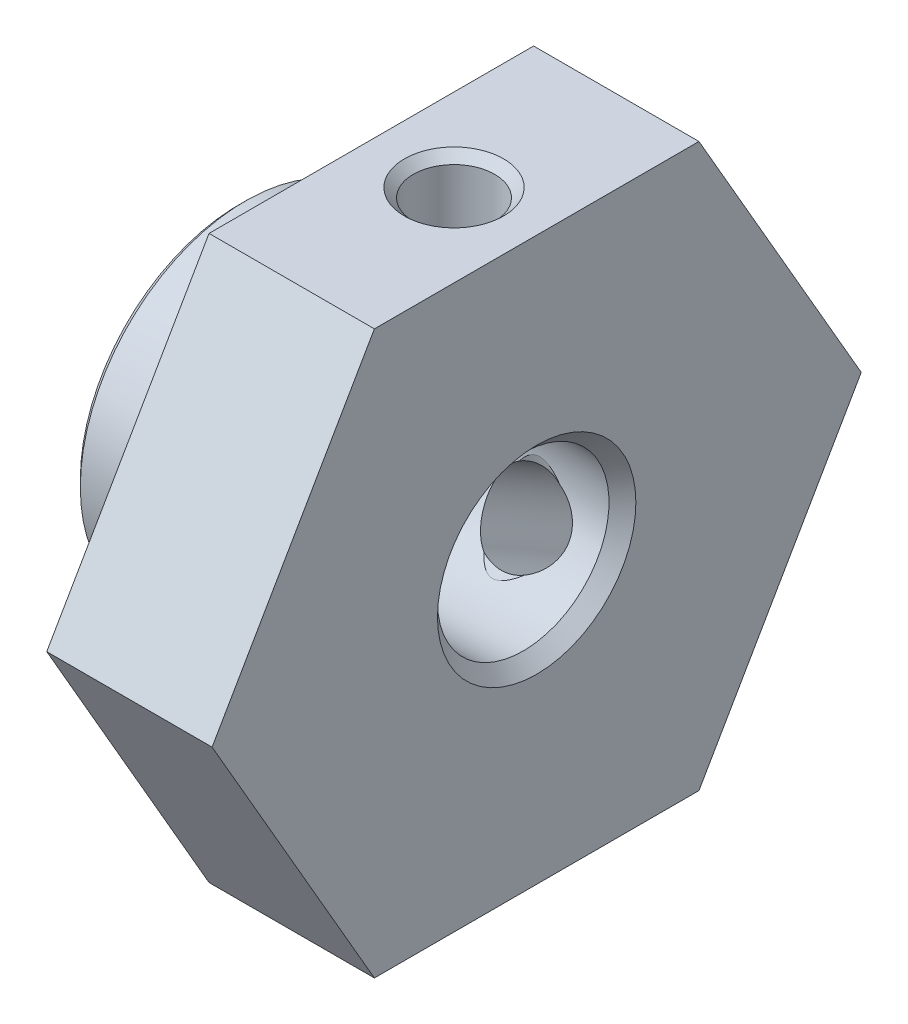
ISO-10303-21;
HEADER;
FILE_DESCRIPTION(('STEP AP214'),'2;1');
FILE_NAME('part.step','',(''),(''),'','','');
FILE_SCHEMA(('AUTOMOTIVE_DESIGN { 1 0 10303 214 1 1 1 1 }'));
ENDSEC;
DATA;
#1=APPLICATION_CONTEXT('core data for automotive mechanical design processes');
#2=APPLICATION_PROTOCOL_DEFINITION('international standard','automotive_design',2000,#1);
#3=PRODUCT_CONTEXT('',#1,'mechanical');
#4=PRODUCT('Part','Part','',(#3));
#5=PRODUCT_RELATED_PRODUCT_CATEGORY('part','',(#4));
#6=PRODUCT_DEFINITION_FORMATION('','',#4);
#7=PRODUCT_DEFINITION_CONTEXT('part definition',#1,'design');
#8=PRODUCT_DEFINITION('design','',#6,#7);
#9=PRODUCT_DEFINITION_SHAPE('','',#8);
#10=(LENGTH_UNIT() NAMED_UNIT(*) SI_UNIT(.MILLI.,.METRE.));
#11=(NAMED_UNIT(*) PLANE_ANGLE_UNIT() SI_UNIT($,.RADIAN.));
#12=(NAMED_UNIT(*) SI_UNIT($,.STERADIAN.) SOLID_ANGLE_UNIT());
#13=UNCERTAINTY_MEASURE_WITH_UNIT(LENGTH_MEASURE(1.E-05),#10,'distance_accuracy_value','');
#14=(GEOMETRIC_REPRESENTATION_CONTEXT(3) GLOBAL_UNCERTAINTY_ASSIGNED_CONTEXT((#13)) GLOBAL_UNIT_ASSIGNED_CONTEXT((#10,
#11,#12)) REPRESENTATION_CONTEXT('',''));
#15=CARTESIAN_POINT('',(0.,0.,0.));
#16=DIRECTION('',(0.,0.,1.));
#17=DIRECTION('',(1.,0.,0.));
#18=AXIS2_PLACEMENT_3D('',#15,#16,#17);
#19=CARTESIAN_POINT('',(9.,0.,0.));
#20=DIRECTION('',(-1.,0.,0.));
#21=DIRECTION('',(0.,0.,1.));
#22=AXIS2_PLACEMENT_3D('',#19,#20,#21);
#23=CYLINDRICAL_SURFACE('',#22,2.594);
#24=CARTESIAN_POINT('',(7.11130557007114,2.3645,1.06675946210943));
#25=CARTESIAN_POINT('',(7.17283329924307,2.3804229380834,1.03150297527811));
#26=CARTESIAN_POINT('',(7.23100469290972,2.39769226485528,0.991096037235716));
#27=CARTESIAN_POINT('',(7.3395891225195,2.43298344496804,0.900970580013275));
#28=CARTESIAN_POINT('',(7.3899853603298,2.45100682359714,0.851232400313027));
#29=CARTESIAN_POINT('',(7.48172195312881,2.48578882449009,0.743569384561638));
#30=CARTESIAN_POINT('',(7.52305827806804,2.50254688174719,0.685640924064241));
#31=CARTESIAN_POINT('',(7.59536277935605,2.53296409349983,0.562947576229603));
#32=CARTESIAN_POINT('',(7.62634213759102,2.54662658494757,0.498190161813476));
#33=CARTESIAN_POINT('',(7.67585190954529,2.56891442894227,0.365864181544286));
#34=CARTESIAN_POINT('',(7.69477657824279,2.57769795200646,0.298470837593822));
#35=CARTESIAN_POINT('',(7.72091963585622,2.58991766875234,0.160977536591798));
#36=CARTESIAN_POINT('',(7.72814352084603,2.59335637296332,0.0908788661333901));
#37=CARTESIAN_POINT('',(7.7304039258054,2.59442907430037,-0.0433039996482899));
#38=CARTESIAN_POINT('',(7.72646568455094,2.59255139670274,-0.107369542585981));
#39=CARTESIAN_POINT('',(7.70875145148675,2.58421839728226,-0.233802702347454));
#40=CARTESIAN_POINT('',(7.69497697513279,2.57776378062347,-0.296170579191969));
#41=CARTESIAN_POINT('',(7.65839685575418,2.56101343778478,-0.416790229436451));
#42=CARTESIAN_POINT('',(7.63570217785813,2.55076499373923,-0.475082584822805));
#43=CARTESIAN_POINT('',(7.58204880060987,2.52733331209461,-0.587114008215008));
#44=CARTESIAN_POINT('',(7.55108450547569,2.51414808827854,-0.640849960491106));
#45=CARTESIAN_POINT('',(7.47904554042583,2.48486031259046,-0.74669317815188));
#46=CARTESIAN_POINT('',(7.43737410431928,2.46861099473553,-0.798352982167304));
#47=CARTESIAN_POINT('',(7.34644987279231,2.43553938828726,-0.894175606907266));
#48=CARTESIAN_POINT('',(7.29720532396884,2.41871773825796,-0.938346473863556));
#49=CARTESIAN_POINT('',(7.20226811547265,2.38929497345709,-1.0106078768721));
#50=CARTESIAN_POINT('',(7.15773519659284,2.37650749911475,-1.04015588903911));
#51=CARTESIAN_POINT('',(7.11130557007114,2.3645,-1.06675946210943));
#52=B_SPLINE_CURVE_WITH_KNOTS('',3,(#24,#25,#26,#27,#28,#29,#30,#31,#32,#33,#34,#35,#36,#37,#38,
#39,#40,#41,#42,#43,#44,#45,#46,#47,#48,#49,#50,#51),.UNSPECIFIED.,.F.,.F.,(4,2,2,2,2,2,2,2,2,2,
2,2,2,4),(0.,0.217712384053668,0.435888737857731,0.65416194524353,0.87219872740545,
1.08267855476251,1.2930594871622,1.48475928203588,1.67642954834547,1.8657873327121,
2.05527357543357,2.25941617927635,2.46333803971736,2.62775890244638),.UNSPECIFIED.);
#53=CARTESIAN_POINT('',(7.11130557007512,2.3645000000015,1.06675946210748));
#54=VERTEX_POINT('',#53);
#55=CARTESIAN_POINT('',(7.11130557007114,2.3645,-1.06675946210943));
#56=VERTEX_POINT('',#55);
#57=EDGE_CURVE('E171',#54,#56,#52,.T.);
#58=ORIENTED_EDGE('',*,*,#57,.T.);
#59=CARTESIAN_POINT('',(7.16108783455756,2.39175,-1.00417525238377));
#60=CARTESIAN_POINT('',(7.13608003947019,2.37788866149612,-1.03721696126421));
#61=CARTESIAN_POINT('',(7.10992590509249,2.36362114904351,-1.06925485586839));
#62=CARTESIAN_POINT('',(7.05493172403082,2.33459008003922,-1.13123488475205));
#63=CARTESIAN_POINT('',(7.02607078006603,2.31982334284631,-1.16115694136222));
#64=CARTESIAN_POINT('',(6.96441720097789,2.2897399994607,-1.21944629923076));
#65=CARTESIAN_POINT('',(6.93151019585101,2.27442641614085,-1.24769511322171));
#66=CARTESIAN_POINT('',(6.86242438203194,2.24477739361206,-1.30027290179945));
#67=CARTESIAN_POINT('',(6.82625925094741,2.23043827138959,-1.32461717049315));
#68=CARTESIAN_POINT('',(6.76409894466059,2.20914823631686,-1.35968895397653));
#69=CARTESIAN_POINT('',(6.7393346976943,2.20143507415852,-1.37211049400494));
#70=CARTESIAN_POINT('',(6.6881944720094,2.187691695571,-1.39391738207763));
#71=CARTESIAN_POINT('',(6.66182937968586,2.181651389609,-1.40332098944318));
#72=CARTESIAN_POINT('',(6.61175544201868,2.172777149557,-1.41701542071826));
#73=CARTESIAN_POINT('',(6.58826998993999,2.16959093868402,-1.42187347582485));
#74=CARTESIAN_POINT('',(6.54065241512918,2.16545325011568,-1.42816790604346));
#75=CARTESIAN_POINT('',(6.51652109668275,2.16449911287724,-1.4296083533062));
#76=CARTESIAN_POINT('',(6.46831317592316,2.16499459796807,-1.42885770511199));
#77=CARTESIAN_POINT('',(6.44423667827866,2.16644719646536,-1.42666211333286));
#78=CARTESIAN_POINT('',(6.39685225175569,2.17150331242237,-1.41895370394312));
#79=CARTESIAN_POINT('',(6.3735454798292,2.17510992493096,-1.41343611294238));
#80=CARTESIAN_POINT('',(6.31675094919156,2.18617969269061,-1.39628120575765));
#81=CARTESIAN_POINT('',(6.28398523047991,2.19466919183898,-1.38296408198598));
#82=CARTESIAN_POINT('',(6.22096050541412,2.21380935145997,-1.35211561707521));
#83=CARTESIAN_POINT('',(6.19072512739402,2.22447773812005,-1.33454947719555));
#84=CARTESIAN_POINT('',(6.12945354585624,2.24810701186622,-1.29439243490119));
#85=CARTESIAN_POINT('',(6.09869150212539,2.26119101610582,-1.271462081225));
#86=CARTESIAN_POINT('',(6.0395945534333,2.28785425328316,-1.2228376503025));
#87=CARTESIAN_POINT('',(6.01126462498815,2.30143442420166,-1.19713813817876));
#88=CARTESIAN_POINT('',(5.95782296739839,2.32804903477104,-1.14449125500444));
#89=CARTESIAN_POINT('',(5.93263075741153,2.34108499624447,-1.11762577711052));
#90=CARTESIAN_POINT('',(5.88429694016077,2.36676686794831,-1.06216200520743));
#91=CARTESIAN_POINT('',(5.86114691842565,2.37941422385326,-1.03357172623689));
#92=CARTESIAN_POINT('',(5.83891216544247,2.39175000000004,-1.00417525238375));
#93=B_SPLINE_CURVE_WITH_KNOTS('',3,(#59,#60,#61,#62,#63,#64,#65,#66,#67,#68,#69,#70,#71,#72,#73,
#74,#75,#76,#77,#78,#79,#80,#81,#82,#83,#84,#85,#86,#87,#88,#89,#90,#91,#92),.UNSPECIFIED.,.F.,
.F.,(4,2,2,2,2,2,2,2,2,2,2,2,2,2,2,2,4),(0.,0.131097506093573,0.26330680666177,
0.401082051116758,0.538303705305195,0.624401304954405,0.709967715530863,0.78224515604404,
0.854436433141115,0.926717048574926,0.999101772932259,1.10760062347554,1.21702008337913,
1.33840819179224,1.46003903788386,1.57714872811023,1.69375084203825),.UNSPECIFIED.);
#94=CARTESIAN_POINT('',(5.88869442992886,2.3645,-1.06675946210943));
#95=VERTEX_POINT('',#94);
#96=EDGE_CURVE('E125',#56,#95,#93,.T.);
#97=ORIENTED_EDGE('',*,*,#96,.T.);
#98=CARTESIAN_POINT('',(5.88869442992886,2.3645,-1.06675946210943));
#99=CARTESIAN_POINT('',(5.82716670075693,2.3804229380834,-1.03150297527811));
#100=CARTESIAN_POINT('',(5.76899530709028,2.39769226485528,-0.991096037235716));
#101=CARTESIAN_POINT('',(5.6604108774805,2.43298344496804,-0.900970580013275));
#102=CARTESIAN_POINT('',(5.6100146396702,2.45100682359714,-0.851232400313027));
#103=CARTESIAN_POINT('',(5.51827804687119,2.48578882449009,-0.743569384561638));
#104=CARTESIAN_POINT('',(5.47694172193196,2.50254688174719,-0.685640924064241));
#105=CARTESIAN_POINT('',(5.40463722064395,2.53296409349983,-0.562947576229603));
#106=CARTESIAN_POINT('',(5.37365786240897,2.54662658494757,-0.498190161813476));
#107=CARTESIAN_POINT('',(5.32414809045471,2.56891442894227,-0.365864181544286));
#108=CARTESIAN_POINT('',(5.30522342175721,2.57769795200646,-0.298470837593822));
#109=CARTESIAN_POINT('',(5.27908036414378,2.58991766875234,-0.160977536591798));
#110=CARTESIAN_POINT('',(5.27185647915397,2.59335637296332,-0.0908788661333902));
#111=CARTESIAN_POINT('',(5.2695960741946,2.59442907430037,0.0433039996482899));
#112=CARTESIAN_POINT('',(5.27353431544906,2.59255139670274,0.107369542585981));
#113=CARTESIAN_POINT('',(5.29124854851325,2.58421839728226,0.233802702347454));
#114=CARTESIAN_POINT('',(5.30502302486721,2.57776378062347,0.296170579191969));
#115=CARTESIAN_POINT('',(5.34160314424582,2.56101343778478,0.416790229436451));
#116=CARTESIAN_POINT('',(5.36429782214187,2.55076499373923,0.475082584822805));
#117=CARTESIAN_POINT('',(5.41795119939013,2.52733331209461,0.587114008215008));
#118=CARTESIAN_POINT('',(5.4489154945243,2.51414808827854,0.640849960491106));
#119=CARTESIAN_POINT('',(5.52095445957417,2.48486031259046,0.74669317815188));
#120=CARTESIAN_POINT('',(5.56262589568072,2.46861099473553,0.798352982167304));
#121=CARTESIAN_POINT('',(5.65355012720769,2.43553938828726,0.894175606907266));
#122=CARTESIAN_POINT('',(5.70279467603116,2.41871773825796,0.938346473863556));
#123=CARTESIAN_POINT('',(5.79773188452735,2.38929497345709,1.0106078768721));
#124=CARTESIAN_POINT('',(5.84226480340716,2.37650749911475,1.04015588903911));
#125=CARTESIAN_POINT('',(5.88869442992886,2.3645,1.06675946210943));
#126=B_SPLINE_CURVE_WITH_KNOTS('',3,(#98,#99,#100,#101,#102,#103,#104,#105,#106,#107,#108,#109,
#110,#111,#112,#113,#114,#115,#116,#117,#118,#119,#120,#121,#122,#123,#124,#125),.UNSPECIFIED.,
.F.,.F.,(4,2,2,2,2,2,2,2,2,2,2,2,2,4),(0.,0.217712384053668,0.435888737857731,0.65416194524353,
0.87219872740545,1.0826785547625,1.2930594871622,1.48475928203588,1.67642954834547,
1.8657873327121,2.05527357543357,2.25941617927635,2.46333803971736,2.62775890244638),.UNSPECIFIED.);
#127=CARTESIAN_POINT('',(5.88869442992886,2.3645,1.06675946210943));
#128=VERTEX_POINT('',#127);
#129=EDGE_CURVE('E127',#95,#128,#126,.T.);
#130=ORIENTED_EDGE('',*,*,#129,.T.);
#131=CARTESIAN_POINT('',(5.83891216544244,2.39175,1.00417525238377));
#132=CARTESIAN_POINT('',(5.86391996052981,2.37788866149612,1.03721696126421));
#133=CARTESIAN_POINT('',(5.89007409490751,2.36362114904351,1.06925485586839));
#134=CARTESIAN_POINT('',(5.94506827596918,2.33459008003922,1.13123488475205));
#135=CARTESIAN_POINT('',(5.97392921993397,2.31982334284631,1.16115694136222));
#136=CARTESIAN_POINT('',(6.03558279902211,2.2897399994607,1.21944629923076));
#137=CARTESIAN_POINT('',(6.06848980414899,2.27442641614085,1.24769511322171));
#138=CARTESIAN_POINT('',(6.13757561796806,2.24477739361206,1.30027290179945));
#139=CARTESIAN_POINT('',(6.17374074905259,2.23043827138959,1.32461717049315));
#140=CARTESIAN_POINT('',(6.23590105533941,2.20914823631686,1.35968895397653));
#141=CARTESIAN_POINT('',(6.2606653023057,2.20143507415852,1.37211049400494));
#142=CARTESIAN_POINT('',(6.3118055279906,2.187691695571,1.39391738207763));
#143=CARTESIAN_POINT('',(6.33817062031414,2.181651389609,1.40332098944318));
#144=CARTESIAN_POINT('',(6.38824455798132,2.172777149557,1.41701542071826));
#145=CARTESIAN_POINT('',(6.41173001006001,2.16959093868402,1.42187347582485));
#146=CARTESIAN_POINT('',(6.45934758487082,2.16545325011568,1.42816790604346));
#147=CARTESIAN_POINT('',(6.48347890331725,2.16449911287724,1.4296083533062));
#148=CARTESIAN_POINT('',(6.53168682407684,2.16499459796807,1.42885770511199));
#149=CARTESIAN_POINT('',(6.55576332172134,2.16644719646536,1.42666211333286));
#150=CARTESIAN_POINT('',(6.60314774824431,2.17150331242237,1.41895370394312));
#151=CARTESIAN_POINT('',(6.6264545201708,2.17510992493096,1.41343611294238));
#152=CARTESIAN_POINT('',(6.68324905080844,2.18617969269061,1.39628120575765));
#153=CARTESIAN_POINT('',(6.71601476952009,2.19466919183898,1.38296408198598));
#154=CARTESIAN_POINT('',(6.77903949458588,2.21380935145997,1.35211561707521));
#155=CARTESIAN_POINT('',(6.80927487260598,2.22447773812005,1.33454947719555));
#156=CARTESIAN_POINT('',(6.87054645414376,2.24810701186622,1.29439243490119));
#157=CARTESIAN_POINT('',(6.90130849787461,2.26119101610582,1.271462081225));
#158=CARTESIAN_POINT('',(6.9604054465667,2.28785425328316,1.2228376503025));
#159=CARTESIAN_POINT('',(6.98873537501185,2.30143442420166,1.19713813817876));
#160=CARTESIAN_POINT('',(7.0421770326016,2.32804903477104,1.14449125500444));
#161=CARTESIAN_POINT('',(7.06736924258847,2.34108499624447,1.11762577711052));
#162=CARTESIAN_POINT('',(7.11570305983923,2.36676686794831,1.06216200520743));
#163=CARTESIAN_POINT('',(7.13885308157434,2.37941422385326,1.03357172623689));
#164=CARTESIAN_POINT('',(7.16108783455752,2.39175000000004,1.00417525238375));
#165=B_SPLINE_CURVE_WITH_KNOTS('',3,(#131,#132,#133,#134,#135,#136,#137,#138,#139,#140,#141,
#142,#143,#144,#145,#146,#147,#148,#149,#150,#151,#152,#153,#154,#155,#156,#157,#158,#159,#160,
#161,#162,#163,#164),.UNSPECIFIED.,.F.,.F.,(4,2,2,2,2,2,2,2,2,2,2,2,2,2,2,2,4),(0.,
0.131097506093572,0.26330680666177,0.401082051116758,0.538303705305195,0.624401304954403,
0.709967715530863,0.78224515604404,0.854436433141115,0.926717048574927,0.999101772932259,
1.10760062347554,1.21702008337913,1.33840819179224,1.46003903788386,1.57714872811023,
1.69375084203825),.UNSPECIFIED.);
#166=EDGE_CURVE('E164',#128,#54,#165,.T.);
#167=ORIENTED_EDGE('',*,*,#166,.T.);
#168=EDGE_LOOP('',(#58,#97,#130,#167));
#169=FACE_BOUND('',#168,.T.);
#170=CARTESIAN_POINT('',(0.406,0.,0.));
#171=DIRECTION('',(-1.,0.,0.));
#172=DIRECTION('',(0.,0.,1.));
#173=AXIS2_PLACEMENT_3D('',#170,#171,#172);
#174=CIRCLE('',#173,2.594);
#175=CARTESIAN_POINT('',(0.406,0.,2.594));
#176=VERTEX_POINT('',#175);
#177=EDGE_CURVE('E241',#176,#176,#174,.T.);
#178=ORIENTED_EDGE('',*,*,#177,.T.);
#179=EDGE_LOOP('',(#178));
#180=FACE_BOUND('',#179,.T.);
#181=CARTESIAN_POINT('',(8.594,0.,0.));
#182=DIRECTION('',(-1.,0.,0.));
#183=DIRECTION('',(0.,0.,1.));
#184=AXIS2_PLACEMENT_3D('',#181,#182,#183);
#185=CIRCLE('',#184,2.594);
#186=CARTESIAN_POINT('',(8.594,0.,2.594));
#187=VERTEX_POINT('',#186);
#188=EDGE_CURVE('E238',#187,#187,#185,.T.);
#189=ORIENTED_EDGE('',*,*,#188,.F.);
#190=EDGE_LOOP('',(#189));
#191=FACE_BOUND('',#190,.T.);
#192=CARTESIAN_POINT('',(5.88869442992874,-2.10609079391417,-1.51433733619361));
#193=CARTESIAN_POINT('',(5.82716670075681,-2.08351924971175,-1.54575524849239));
#194=CARTESIAN_POINT('',(5.76899530709017,-2.05716047826383,-1.5809143932043));
#195=CARTESIAN_POINT('',(5.66041087748039,-1.99675513283788,-1.65654018032271));
#196=CARTESIAN_POINT('',(5.6100146396701,-1.96269229499402,-1.69701797392766));
#197=CARTESIAN_POINT('',(5.5182780468711,-1.88684438875173,-1.78097157817111));
#198=CARTESIAN_POINT('',(5.47694172193187,-1.84505589898741,-1.82444871172253));
#199=CARTESIAN_POINT('',(5.40463722064387,-1.75400894876356,-1.91213746372993));
#200=CARTESIAN_POINT('',(5.3736578624089,-1.70475862851967,-1.95634823561073));
#201=CARTESIAN_POINT('',(5.32414809045465,-1.60130489002321,-2.04181306484032));
#202=CARTESIAN_POINT('',(5.30522342175715,-1.54733230364822,-2.08311649092387));
#203=CARTESIAN_POINT('',(5.27908036414373,-1.43436947050322,-2.16244572655386));
#204=CARTESIAN_POINT('',(5.27185647915394,-1.37538159322021,-2.20047306698586));
#205=CARTESIAN_POINT('',(5.26959607419458,-1.2597121733692,-2.26849348648526));
#206=CARTESIAN_POINT('',(5.27353431544904,-1.2032909468791,-2.29890014145443));
#207=CARTESIAN_POINT('',(5.29124854851325,-1.08963011893469,-2.35490013214732));
#208=CARTESIAN_POINT('',(5.30502302486721,-1.03239064487785,-2.38049420857136));
#209=CARTESIAN_POINT('',(5.34160314424583,-0.919555792151185,-2.4262978112732));
#210=CARTESIAN_POINT('',(5.36429782214189,-0.863948909517396,-2.44656857607366));
#211=CARTESIAN_POINT('',(5.41795119939015,-0.75521101001531,-2.48229185621213));
#212=CARTESIAN_POINT('',(5.44891549452433,-0.702081698339623,-2.49774109357087));
#213=CARTESIAN_POINT('',(5.52095445957421,-0.595774895183066,-2.52529874463504));
#214=CARTESIAN_POINT('',(5.56262589568077,-0.542911533623723,-2.53705632458622));
#215=CARTESIAN_POINT('',(5.65355012720775,-0.443390903117478,-2.55632678562803));
#216=CARTESIAN_POINT('',(5.70279467603122,-0.396726985211499,-2.56384424284722));
#217=CARTESIAN_POINT('',(5.79773188452737,-0.319435392092613,-2.57449408258436));
#218=CARTESIAN_POINT('',(5.84226480340712,-0.287452325753515,-2.57819381103715));
#219=CARTESIAN_POINT('',(5.88869442992876,-0.258409206085846,-2.58109679830302));
#220=B_SPLINE_CURVE_WITH_KNOTS('',3,(#192,#193,#194,#195,#196,#197,#198,#199,#200,#201,#202,
#203,#204,#205,#206,#207,#208,#209,#210,#211,#212,#213,#214,#215,#216,#217,#218,#219),
.UNSPECIFIED.,.F.,.F.,(4,2,2,2,2,2,2,2,2,2,2,2,2,4),(0.,0.217712384053673,0.43588873785774,
0.654161945243546,0.872198727405472,1.08267855476253,1.29305948716222,1.4847592820359,
1.67642954834549,1.86578733271212,2.0552735754336,2.25941617927639,2.46333803971741,
2.62775890244621),.UNSPECIFIED.);
#221=CARTESIAN_POINT('',(5.88869442992875,-2.10609079391417,-1.51433733619361));
#222=VERTEX_POINT('',#221);
#223=CARTESIAN_POINT('',(5.88869442992877,-0.258409206085846,-2.58109679830302));
#224=VERTEX_POINT('',#223);
#225=EDGE_CURVE('E35',#222,#224,#220,.T.);
#226=ORIENTED_EDGE('',*,*,#225,.T.);
#227=CARTESIAN_POINT('',(5.50388304550991,-1.19846727659727,-2.30054606276984));
#228=CARTESIAN_POINT('',(5.50938658718427,-1.12780388006646,-2.33736036512866));
#229=CARTESIAN_POINT('',(5.52075950437193,-1.05580573698441,-2.37069570186363));
#230=CARTESIAN_POINT('',(5.55445603871214,-0.911344337720269,-2.42989432286393));
#231=CARTESIAN_POINT('',(5.57678044166135,-0.838881048531043,-2.45575707074057));
#232=CARTESIAN_POINT('',(5.63167585515638,-0.694083566807484,-2.50058894573353));
#233=CARTESIAN_POINT('',(5.66443280749854,-0.621777776780946,-2.51941833114112));
#234=CARTESIAN_POINT('',(5.73889207994243,-0.480229880400842,-2.55018945708196));
#235=CARTESIAN_POINT('',(5.78061110835065,-0.410993791897899,-2.56211817693569));
#236=CARTESIAN_POINT('',(5.86976633748097,-0.281058229906232,-2.57951777599928));
#237=CARTESIAN_POINT('',(5.91676748632418,-0.220099202924344,-2.58530495009201));
#238=CARTESIAN_POINT('',(6.01836587288765,-0.104696004820024,-2.59251819779675));
#239=CARTESIAN_POINT('',(6.07293223651213,-0.0502269480144484,-2.59396148122718));
#240=CARTESIAN_POINT('',(6.15679469581257,0.0182494878553374,-2.59401504855953));
#241=CARTESIAN_POINT('',(6.18204559161179,0.0371928396139645,-2.59379323975599));
#242=CARTESIAN_POINT('',(6.23453140957459,0.0722389387559833,-2.59305249510194));
#243=CARTESIAN_POINT('',(6.26176864280721,0.0883383002367059,-2.59253320816779));
#244=CARTESIAN_POINT('',(6.31886596983016,0.11662597156985,-2.59141641883817));
#245=CARTESIAN_POINT('',(6.34876308281246,0.128742344187686,-2.59081772605639));
#246=CARTESIAN_POINT('',(6.41034223429755,0.146694606206253,-2.58986547449518));
#247=CARTESIAN_POINT('',(6.44201414258028,0.152562944472351,-2.58951065262786));
#248=CARTESIAN_POINT('',(6.50142893432492,0.156378778077344,-2.58928257309613));
#249=CARTESIAN_POINT('',(6.52910705003063,0.155312556741193,-2.58934931459801));
#250=CARTESIAN_POINT('',(6.58373903723086,0.147757711561433,-2.58979080751506));
#251=CARTESIAN_POINT('',(6.61069087815919,0.141255243951483,-2.59016634526042));
#252=CARTESIAN_POINT('',(6.66983239741282,0.121709553937841,-2.59116520775294));
#253=CARTESIAN_POINT('',(6.70159357512015,0.10741689414535,-2.59182737457315));
#254=CARTESIAN_POINT('',(6.76262501858673,0.0742554936079364,-2.59299076721768));
#255=CARTESIAN_POINT('',(6.79188751956752,0.0553731428855056,-2.59349150387871));
#256=CARTESIAN_POINT('',(6.87483874635658,-0.00465923563397107,-2.594294065667));
#257=CARTESIAN_POINT('',(6.92547206048663,-0.0499871778791355,-2.59396052470188));
#258=CARTESIAN_POINT('',(7.02037389992108,-0.146706839757141,-2.59030950239663));
#259=CARTESIAN_POINT('',(7.06462424599979,-0.198115148381107,-2.58698368619891));
#260=CARTESIAN_POINT('',(7.16524768516267,-0.328010263446798,-2.57432018847834));
#261=CARTESIAN_POINT('',(7.21865474146075,-0.408637456261522,-2.56301272162989));
#262=CARTESIAN_POINT('',(7.31323221855682,-0.575002396326974,-2.53088525971234));
#263=CARTESIAN_POINT('',(7.354413655856,-0.660735458513977,-2.51007387181776));
#264=CARTESIAN_POINT('',(7.4054165264933,-0.790767334256604,-2.47094443167833));
#265=CARTESIAN_POINT('',(7.42059506794787,-0.834226582290715,-2.45663348346034));
#266=CARTESIAN_POINT('',(7.44717723989209,-0.921316693357848,-2.4253140594609));
#267=CARTESIAN_POINT('',(7.45858291598971,-0.964947450372153,-2.40830705287788));
#268=CARTESIAN_POINT('',(7.47736949446926,-1.05190744955163,-2.37161348351385));
#269=CARTESIAN_POINT('',(7.4847539816185,-1.09523692616173,-2.35192932696269));
#270=CARTESIAN_POINT('',(7.49533954504221,-1.18113501037105,-2.3099881760236));
#271=CARTESIAN_POINT('',(7.49854141218817,-1.22370376031054,-2.28773166889564));
#272=CARTESIAN_POINT('',(7.50140059252727,-1.33693882844688,-2.2244245165888));
#273=CARTESIAN_POINT('',(7.49702686385575,-1.40648938222507,-2.18109440005667));
#274=CARTESIAN_POINT('',(7.47623429298484,-1.53988790240963,-2.08905839427344));
#275=CARTESIAN_POINT('',(7.45981888005489,-1.60373748655067,-2.04035403886947));
#276=CARTESIAN_POINT('',(7.41675044280397,-1.72253002746755,-1.94101434307772));
#277=CARTESIAN_POINT('',(7.39043826413837,-1.77769108396697,-1.89048907631685));
#278=CARTESIAN_POINT('',(7.32871479532358,-1.88103524808331,-1.78769874701476));
#279=CARTESIAN_POINT('',(7.29328445804734,-1.92920341460601,-1.7354302443684));
#280=CARTESIAN_POINT('',(7.20864637586031,-2.02477039323396,-1.62336955294946));
#281=CARTESIAN_POINT('',(7.15818828368042,-2.07105514358823,-1.56358008897954));
#282=CARTESIAN_POINT('',(7.0472515593227,-2.15411494972569,-1.4469484832729));
#283=CARTESIAN_POINT('',(6.98681079326088,-2.19092464535363,-1.39009623102624));
#284=CARTESIAN_POINT('',(6.89546554233853,-2.23414530993516,-1.31831875452906));
#285=CARTESIAN_POINT('',(6.86980560176188,-2.24514437622687,-1.29945731435571));
#286=CARTESIAN_POINT('',(6.81641227594555,-2.26545497527008,-1.26371210745799));
#287=CARTESIAN_POINT('',(6.78867580249852,-2.27476392113205,-1.24683138614895));
#288=CARTESIAN_POINT('',(6.73044912983819,-2.29140966392054,-1.21597247140285));
#289=CARTESIAN_POINT('',(6.69992412305579,-2.29871508517318,-1.20204115823092));
#290=CARTESIAN_POINT('',(6.63650877083502,-2.31043056220542,-1.17937026092893));
#291=CARTESIAN_POINT('',(6.60363144357371,-2.31485536385734,-1.17060425787367));
#292=CARTESIAN_POINT('',(6.54664096341902,-2.31925978064492,-1.16184597314974));
#293=CARTESIAN_POINT('',(6.52289006436462,-2.32017995015027,-1.16000024917419));
#294=CARTESIAN_POINT('',(6.4753922997572,-2.32013377113395,-1.16009297484064));
#295=CARTESIAN_POINT('',(6.45164543459351,-2.31916729296768,-1.16203168453724));
#296=CARTESIAN_POINT('',(6.40500313751318,-2.31547993768403,-1.16936040333008));
#297=CARTESIAN_POINT('',(6.38210351052346,-2.31276943974,-1.17472999294415));
#298=CARTESIAN_POINT('',(6.33737081523047,-2.30586439076894,-1.18822695571065));
#299=CARTESIAN_POINT('',(6.31553909000592,-2.30166802297481,-1.19635770442096));
#300=CARTESIAN_POINT('',(6.2537627825803,-2.28770230098629,-1.22296111257678));
#301=CARTESIAN_POINT('',(6.21535751602213,-2.27633112918433,-1.24412352645921));
#302=CARTESIAN_POINT('',(6.14222948466012,-2.25037198542233,-1.29049735975172));
#303=CARTESIAN_POINT('',(6.10752419803911,-2.23576966826185,-1.31572669486573));
#304=CARTESIAN_POINT('',(6.01036737790214,-2.18912578745977,-1.39285687969818));
#305=CARTESIAN_POINT('',(5.95204874724074,-2.1534742466467,-1.44778521259614));
#306=CARTESIAN_POINT('',(5.84486460281243,-2.0734543007809,-1.56027382466045));
#307=CARTESIAN_POINT('',(5.79600765752655,-2.02907806726344,-1.61783643164762));
#308=CARTESIAN_POINT('',(5.70572514856655,-1.9289594899344,-1.7361607294405));
#309=CARTESIAN_POINT('',(5.66482993017413,-1.87273979536294,-1.79693045242447));
#310=CARTESIAN_POINT('',(5.59551419361413,-1.7508193018726,-1.9159072139838));
#311=CARTESIAN_POINT('',(5.5670717048343,-1.68513547517408,-1.97411860164986));
#312=CARTESIAN_POINT('',(5.5263914975018,-1.55158815621048,-2.08038873834185));
#313=CARTESIAN_POINT('',(5.5129229038839,-1.4844564542154,-2.12888962567836));
#314=CARTESIAN_POINT('',(5.49879162973605,-1.34485822011007,-2.21971043419646));
#315=CARTESIAN_POINT('',(5.49812540791056,-1.27239316883823,-2.2620320614238));
#316=CARTESIAN_POINT('',(5.50388304550991,-1.19846727659727,-2.30054606276984));
#317=B_SPLINE_CURVE_WITH_KNOTS('',3,(#227,#228,#229,#230,#231,#232,#233,#234,#235,#236,#237,
#238,#239,#240,#241,#242,#243,#244,#245,#246,#247,#248,#249,#250,#251,#252,#253,#254,#255,#256,
#257,#258,#259,#260,#261,#262,#263,#264,#265,#266,#267,#268,#269,#270,#271,#272,#273,#274,#275,
#276,#277,#278,#279,#280,#281,#282,#283,#284,#285,#286,#287,#288,#289,#290,#291,#292,#293,#294,
#295,#296,#297,#298,#299,#300,#301,#302,#303,#304,#305,#306,#307,#308,#309,#310,#311,#312,#313,
#314,#315,#316),.UNSPECIFIED.,.T.,.F.,(4,2,2,2,2,2,2,2,2,2,2,2,2,2,2,2,2,2,2,2,2,2,2,2,2,2,2,2,
2,2,2,2,2,2,2,2,2,2,2,2,2,2,2,2,4),(0.,0.239300058686465,0.47861729026632,0.72246411866859,
0.96676956682028,1.19777107932289,1.42785618708638,1.52242606053374,1.61710777594648,
1.71341598754335,1.80922155017143,1.89173042071522,1.97445004793376,2.07837553909921,
2.18261304671379,2.38537541478556,2.5887043234839,2.87944057938397,3.16991405215037,
3.31434579583269,3.45869910129194,3.60292350862839,3.74712064131635,3.9919130405994,
4.23663575416903,4.47360471365719,4.71107275874781,4.98280845832145,5.25353613863652,
5.35450132516364,5.45561976911196,5.55824146007192,5.66033361227279,5.73149766053133,
5.80266659913577,5.87341585959502,5.94425192531215,6.0793621027165,6.21508460876966,
6.47673458229083,6.73862040863939,7.01437045680036,7.28963201333321,7.54004971258633,
7.79039814218663),.UNSPECIFIED.);
#318=CARTESIAN_POINT('',(7.11130557007123,-0.258409206085846,-2.58109679830302));
#319=VERTEX_POINT('',#318);
#320=EDGE_CURVE('E11',#224,#319,#317,.T.);
#321=ORIENTED_EDGE('',*,*,#320,.T.);
#322=CARTESIAN_POINT('',(7.11130557007124,-0.258409206085846,-2.58109679830302));
#323=CARTESIAN_POINT('',(7.17283329924317,-0.296903688371672,-2.57725822377046));
#324=CARTESIAN_POINT('',(7.23100469290982,-0.340531786591469,-2.57201043043997));
#325=CARTESIAN_POINT('',(7.33958912251959,-0.43622831213018,-2.55751076033593));
#326=CARTESIAN_POINT('',(7.38998536032989,-0.488314528603148,-2.54825037424063));
#327=CARTESIAN_POINT('',(7.48172195312889,-0.598944435738375,-2.52454096273268));
#328=CARTESIAN_POINT('',(7.52305827806811,-0.6574909827598,-2.5100896357867));
#329=CARTESIAN_POINT('',(7.59536277935612,-0.778955144736284,-2.47508503995945));
#330=CARTESIAN_POINT('',(7.62634213759109,-0.841867956427923,-2.45453839742412));
#331=CARTESIAN_POINT('',(7.67585190954535,-0.967609538919069,-2.40767724638451));
#332=CARTESIAN_POINT('',(7.69477657824285,-1.03036564835825,-2.38158732851759));
#333=CARTESIAN_POINT('',(7.72091963585626,-1.15554819824912,-2.32342326314555));
#334=CARTESIAN_POINT('',(7.72814352084606,-1.21797477974311,-2.29135193311915));
#335=CARTESIAN_POINT('',(7.73040392580542,-1.33471690093116,-2.22518948683687));
#336=CARTESIAN_POINT('',(7.72646568455096,-1.38926044982363,-2.19153059886835));
#337=CARTESIAN_POINT('',(7.70875145148676,-1.49458827834756,-2.12109742979976));
#338=CARTESIAN_POINT('',(7.69497697513279,-1.54537313574561,-2.0843236293793));
#339=CARTESIAN_POINT('',(7.65839685575418,-1.64145764563358,-2.00950758183665));
#340=CARTESIAN_POINT('',(7.63570217785812,-1.68681608422181,-1.97148599125076));
#341=CARTESIAN_POINT('',(7.58204880060986,-1.77212230207928,-1.89517784799703));
#342=CARTESIAN_POINT('',(7.55108450547568,-1.81206638993889,-1.85689113307967));
#343=CARTESIAN_POINT('',(7.4790455404258,-1.88908541740736,-1.77860556648306));
#344=CARTESIAN_POINT('',(7.43737410431924,-1.92569946111178,-1.73870334241882));
#345=CARTESIAN_POINT('',(7.34644987279226,-1.99214848516975,-1.66215117872067));
#346=CARTESIAN_POINT('',(7.29720532396879,-2.02199075304643,-1.62549776898358));
#347=CARTESIAN_POINT('',(7.20226811547264,-2.06985958136446,-1.56388620571222));
#348=CARTESIAN_POINT('',(7.15773519659289,-2.08905517336124,-1.53803792199804));
#349=CARTESIAN_POINT('',(7.11130557007126,-2.10609079391417,-1.51433733619361));
#350=B_SPLINE_CURVE_WITH_KNOTS('',3,(#322,#323,#324,#325,#326,#327,#328,#329,#330,#331,#332,
#333,#334,#335,#336,#337,#338,#339,#340,#341,#342,#343,#344,#345,#346,#347,#348,#349),
.UNSPECIFIED.,.F.,.F.,(4,2,2,2,2,2,2,2,2,2,2,2,2,4),(0.,0.217712384053673,0.43588873785774,
0.654161945243546,0.872198727405471,1.08267855476253,1.29305948716222,1.4847592820359,
1.67642954834549,1.86578733271213,2.0552735754336,2.25941617927639,2.46333803971741,
2.62775890244621),.UNSPECIFIED.);
#351=CARTESIAN_POINT('',(7.11130557007125,-2.10609079391417,-1.51433733619361));
#352=VERTEX_POINT('',#351);
#353=EDGE_CURVE('E115',#319,#352,#350,.T.);
#354=ORIENTED_EDGE('',*,*,#353,.T.);
#355=EDGE_CURVE('E46',#352,#222,#317,.T.);
#356=ORIENTED_EDGE('',*,*,#355,.T.);
#357=EDGE_LOOP('',(#226,#321,#354,#356));
#358=FACE_BOUND('',#357,.T.);
#359=ADVANCED_FACE('F31',(#169,#180,#191,#358),#23,.F.);
#360=CARTESIAN_POINT('',(9.,-8.5,-4.9074772881118));
#361=DIRECTION('',(0.,0.499999999999999,0.866025403784439));
#362=DIRECTION('',(0.,-0.866025403784439,0.499999999999999));
#363=AXIS2_PLACEMENT_3D('',#360,#361,#362);
#364=PLANE('',#363);
#365=DIRECTION('',(-1.,0.,0.));
#366=VECTOR('',#365,1.);
#367=CARTESIAN_POINT('',(9.,0.,-9.8149545762236));
#368=LINE('',#367,#366);
#369=CARTESIAN_POINT('',(9.,0.,-9.8149545762236));
#370=VERTEX_POINT('',#369);
#371=CARTESIAN_POINT('',(4.,0.,-9.8149545762236));
#372=VERTEX_POINT('',#371);
#373=EDGE_CURVE('E223',#370,#372,#368,.T.);
#374=ORIENTED_EDGE('',*,*,#373,.F.);
#375=DIRECTION('',(0.,0.866025403784439,-0.499999999999999));
#376=VECTOR('',#375,1.);
#377=CARTESIAN_POINT('',(9.,-8.5,-4.9074772881118));
#378=LINE('',#377,#376);
#379=CARTESIAN_POINT('',(9.,-8.5,-4.9074772881118));
#380=VERTEX_POINT('',#379);
#381=EDGE_CURVE('E209',#380,#370,#378,.T.);
#382=ORIENTED_EDGE('',*,*,#381,.F.);
#383=DIRECTION('',(-1.,0.,0.));
#384=VECTOR('',#383,1.);
#385=CARTESIAN_POINT('',(9.,-8.5,-4.9074772881118));
#386=LINE('',#385,#384);
#387=CARTESIAN_POINT('',(4.,-8.5,-4.9074772881118));
#388=VERTEX_POINT('',#387);
#389=EDGE_CURVE('E226',#380,#388,#386,.T.);
#390=ORIENTED_EDGE('',*,*,#389,.T.);
#391=DIRECTION('',(0.,-0.866025403784439,0.499999999999999));
#392=VECTOR('',#391,1.);
#393=CARTESIAN_POINT('',(4.,-0.499999999999969,-9.52627944162881));
#394=LINE('',#393,#392);
#395=EDGE_CURVE('E262',#372,#388,#394,.T.);
#396=ORIENTED_EDGE('',*,*,#395,.F.);
#397=EDGE_LOOP('',(#374,#382,#390,#396));
#398=FACE_BOUND('',#397,.T.);
#399=CARTESIAN_POINT('',(6.5,-4.25000000000001,-7.36121593216772));
#400=DIRECTION('',(0.,-0.500000000000001,-0.866025403784438));
#401=DIRECTION('',(0.,0.866025403784438,-0.500000000000001));
#402=AXIS2_PLACEMENT_3D('',#399,#400,#401);
#403=CIRCLE('',#402,1.50000000000004);
#404=CARTESIAN_POINT('',(6.5,-2.95096189432332,-8.11121593216774));
#405=VERTEX_POINT('',#404);
#406=EDGE_CURVE('E194',#405,#405,#403,.T.);
#407=ORIENTED_EDGE('',*,*,#406,.F.);
#408=EDGE_LOOP('',(#407));
#409=FACE_BOUND('',#408,.T.);
#410=ADVANCED_FACE('F292',(#398,#409),#364,.F.);
#411=CARTESIAN_POINT('',(9.,8.5,-4.9074772881118));
#412=DIRECTION('',(0.,-1.,0.));
#413=DIRECTION('',(0.,0.,-1.));
#414=AXIS2_PLACEMENT_3D('',#411,#412,#413);
#415=PLANE('',#414);
#416=DIRECTION('',(-1.,0.,0.));
#417=VECTOR('',#416,1.);
#418=CARTESIAN_POINT('',(9.,8.5,4.9074772881118));
#419=LINE('',#418,#417);
#420=CARTESIAN_POINT('',(9.,8.5,4.9074772881118));
#421=VERTEX_POINT('',#420);
#422=CARTESIAN_POINT('',(4.,8.5,4.9074772881118));
#423=VERTEX_POINT('',#422);
#424=EDGE_CURVE('E218',#421,#423,#419,.T.);
#425=ORIENTED_EDGE('',*,*,#424,.F.);
#426=DIRECTION('',(0.,0.,1.));
#427=VECTOR('',#426,1.);
#428=CARTESIAN_POINT('',(9.,8.5,-4.9074772881118));
#429=LINE('',#428,#427);
#430=CARTESIAN_POINT('',(9.,8.5,-4.9074772881118));
#431=VERTEX_POINT('',#430);
#432=EDGE_CURVE('E215',#431,#421,#429,.T.);
#433=ORIENTED_EDGE('',*,*,#432,.F.);
#434=DIRECTION('',(-1.,0.,0.));
#435=VECTOR('',#434,1.);
#436=CARTESIAN_POINT('',(9.,8.5,-4.9074772881118));
#437=LINE('',#436,#435);
#438=CARTESIAN_POINT('',(4.,8.5,-4.9074772881118));
#439=VERTEX_POINT('',#438);
#440=EDGE_CURVE('E221',#431,#439,#437,.T.);
#441=ORIENTED_EDGE('',*,*,#440,.T.);
#442=DIRECTION('',(0.,0.,-1.));
#443=VECTOR('',#442,1.);
#444=CARTESIAN_POINT('',(4.,8.5,0.));
#445=LINE('',#444,#443);
#446=EDGE_CURVE('E256',#423,#439,#445,.T.);
#447=ORIENTED_EDGE('',*,*,#446,.F.);
#448=EDGE_LOOP('',(#425,#433,#441,#447));
#449=FACE_BOUND('',#448,.T.);
#450=CARTESIAN_POINT('',(6.5,8.5,0.));
#451=DIRECTION('',(0.,1.,0.));
#452=DIRECTION('',(0.,0.,1.));
#453=AXIS2_PLACEMENT_3D('',#450,#451,#452);
#454=CIRCLE('',#453,1.5);
#455=CARTESIAN_POINT('',(6.5,8.5,1.5));
#456=VERTEX_POINT('',#455);
#457=EDGE_CURVE('E192',#456,#456,#454,.T.);
#458=ORIENTED_EDGE('',*,*,#457,.F.);
#459=EDGE_LOOP('',(#458));
#460=FACE_BOUND('',#459,.T.);
#461=ADVANCED_FACE('F285',(#449,#460),#415,.F.);
#462=CARTESIAN_POINT('',(0.,0.,0.));
#463=DIRECTION('',(1.,0.,0.));
#464=DIRECTION('',(0.,0.,-1.));
#465=AXIS2_PLACEMENT_3D('',#462,#463,#464);
#466=PLANE('',#465);
#467=CARTESIAN_POINT('',(0.,0.,0.));
#468=DIRECTION('',(-1.,0.,0.));
#469=DIRECTION('',(0.,0.,1.));
#470=AXIS2_PLACEMENT_3D('',#467,#468,#469);
#471=CIRCLE('',#470,4.8);
#472=CARTESIAN_POINT('',(0.,0.,4.8));
#473=VERTEX_POINT('',#472);
#474=EDGE_CURVE('E253',#473,#473,#471,.T.);
#475=ORIENTED_EDGE('',*,*,#474,.T.);
#476=EDGE_LOOP('',(#475));
#477=FACE_BOUND('',#476,.T.);
#478=CARTESIAN_POINT('',(0.,0.,0.));
#479=DIRECTION('',(-1.,0.,0.));
#480=DIRECTION('',(0.,0.,1.));
#481=AXIS2_PLACEMENT_3D('',#478,#479,#480);
#482=CIRCLE('',#481,3.);
#483=CARTESIAN_POINT('',(0.,0.,3.));
#484=VERTEX_POINT('',#483);
#485=EDGE_CURVE('E244',#484,#484,#482,.T.);
#486=ORIENTED_EDGE('',*,*,#485,.F.);
#487=EDGE_LOOP('',(#486));
#488=FACE_BOUND('',#487,.T.);
#489=ADVANCED_FACE('F33',(#477,#488),#466,.F.);
#490=CARTESIAN_POINT('',(9.,10.2,0.));
#491=DIRECTION('',(-1.,0.,0.));
#492=DIRECTION('',(0.,0.,1.));
#493=AXIS2_PLACEMENT_3D('',#490,#491,#492);
#494=PLANE('',#493);
#495=ORIENTED_EDGE('',*,*,#432,.T.);
#496=DIRECTION('',(0.,-0.866025403784439,0.499999999999999));
#497=VECTOR('',#496,1.);
#498=CARTESIAN_POINT('',(9.,8.5,4.9074772881118));
#499=LINE('',#498,#497);
#500=CARTESIAN_POINT('',(9.,0.,9.8149545762236));
#501=VERTEX_POINT('',#500);
#502=EDGE_CURVE('E200',#421,#501,#499,.T.);
#503=ORIENTED_EDGE('',*,*,#502,.T.);
#504=DIRECTION('',(0.,-0.866025403784439,-0.499999999999999));
#505=VECTOR('',#504,1.);
#506=CARTESIAN_POINT('',(9.,0.,9.8149545762236));
#507=LINE('',#506,#505);
#508=CARTESIAN_POINT('',(9.,-8.5,4.9074772881118));
#509=VERTEX_POINT('',#508);
#510=EDGE_CURVE('E203',#501,#509,#507,.T.);
#511=ORIENTED_EDGE('',*,*,#510,.T.);
#512=DIRECTION('',(0.,0.,-1.));
#513=VECTOR('',#512,1.);
#514=CARTESIAN_POINT('',(9.,-8.5,4.9074772881118));
#515=LINE('',#514,#513);
#516=EDGE_CURVE('E206',#509,#380,#515,.T.);
#517=ORIENTED_EDGE('',*,*,#516,.T.);
#518=ORIENTED_EDGE('',*,*,#381,.T.);
#519=DIRECTION('',(0.,0.866025403784439,0.499999999999999));
#520=VECTOR('',#519,1.);
#521=CARTESIAN_POINT('',(9.,0.,-9.8149545762236));
#522=LINE('',#521,#520);
#523=EDGE_CURVE('E212',#370,#431,#522,.T.);
#524=ORIENTED_EDGE('',*,*,#523,.T.);
#525=EDGE_LOOP('',(#495,#503,#511,#517,#518,#524));
#526=FACE_BOUND('',#525,.T.);
#527=CARTESIAN_POINT('',(9.,0.,0.));
#528=DIRECTION('',(-1.,0.,0.));
#529=DIRECTION('',(0.,0.,1.));
#530=AXIS2_PLACEMENT_3D('',#527,#528,#529);
#531=CIRCLE('',#530,3.);
#532=CARTESIAN_POINT('',(9.,0.,3.));
#533=VERTEX_POINT('',#532);
#534=EDGE_CURVE('E235',#533,#533,#531,.T.);
#535=ORIENTED_EDGE('',*,*,#534,.T.);
#536=EDGE_LOOP('',(#535));
#537=FACE_BOUND('',#536,.T.);
#538=ADVANCED_FACE('F281',(#526,#537),#494,.F.);
#539=CARTESIAN_POINT('',(0.200000000000001,0.,0.));
#540=DIRECTION('',(1.,0.,0.));
#541=DIRECTION('',(0.,0.,-1.));
#542=AXIS2_PLACEMENT_3D('',#539,#540,#541);
#543=CONICAL_SURFACE('',#542,5.,0.785398163397448);
#544=ORIENTED_EDGE('',*,*,#474,.F.);
#545=EDGE_LOOP('',(#544));
#546=FACE_BOUND('',#545,.T.);
#547=CARTESIAN_POINT('',(0.200000000000001,0.,0.));
#548=DIRECTION('',(-1.,0.,0.));
#549=DIRECTION('',(0.,0.,1.));
#550=AXIS2_PLACEMENT_3D('',#547,#548,#549);
#551=CIRCLE('',#550,5.);
#552=CARTESIAN_POINT('',(0.200000000000001,0.,5.));
#553=VERTEX_POINT('',#552);
#554=EDGE_CURVE('E250',#553,#553,#551,.T.);
#555=ORIENTED_EDGE('',*,*,#554,.T.);
#556=EDGE_LOOP('',(#555));
#557=FACE_BOUND('',#556,.T.);
#558=ADVANCED_FACE('F356',(#546,#557),#543,.T.);
#559=CARTESIAN_POINT('',(9.,0.,0.));
#560=DIRECTION('',(-1.,0.,0.));
#561=DIRECTION('',(0.,0.,1.));
#562=AXIS2_PLACEMENT_3D('',#559,#560,#561);
#563=CYLINDRICAL_SURFACE('',#562,5.);
#564=ORIENTED_EDGE('',*,*,#554,.F.);
#565=EDGE_LOOP('',(#564));
#566=FACE_BOUND('',#565,.T.);
#567=CARTESIAN_POINT('',(4.,0.,0.));
#568=DIRECTION('',(-1.,0.,0.));
#569=DIRECTION('',(0.,0.,1.));
#570=AXIS2_PLACEMENT_3D('',#567,#568,#569);
#571=CIRCLE('',#570,5.);
#572=CARTESIAN_POINT('',(4.,0.,5.));
#573=VERTEX_POINT('',#572);
#574=EDGE_CURVE('E247',#573,#573,#571,.T.);
#575=ORIENTED_EDGE('',*,*,#574,.T.);
#576=EDGE_LOOP('',(#575));
#577=FACE_BOUND('',#576,.T.);
#578=ADVANCED_FACE('F365',(#566,#577),#563,.T.);
#579=CARTESIAN_POINT('',(4.,5.,0.));
#580=DIRECTION('',(1.,0.,0.));
#581=DIRECTION('',(0.,0.,-1.));
#582=AXIS2_PLACEMENT_3D('',#579,#580,#581);
#583=PLANE('',#582);
#584=DIRECTION('',(0.,0.866025403784439,0.499999999999999));
#585=VECTOR('',#584,1.);
#586=CARTESIAN_POINT('',(4.,-0.499999999999968,9.52627944162881));
#587=LINE('',#586,#585);
#588=CARTESIAN_POINT('',(4.,-8.5,4.9074772881118));
#589=VERTEX_POINT('',#588);
#590=CARTESIAN_POINT('',(4.,0.,9.8149545762236));
#591=VERTEX_POINT('',#590);
#592=EDGE_CURVE('E267',#589,#591,#587,.T.);
#593=ORIENTED_EDGE('',*,*,#592,.T.);
#594=DIRECTION('',(0.,0.866025403784439,-0.499999999999999));
#595=VECTOR('',#594,1.);
#596=CARTESIAN_POINT('',(4.,7.99999999999998,5.19615242270662));
#597=LINE('',#596,#595);
#598=EDGE_CURVE('E172',#591,#423,#597,.T.);
#599=ORIENTED_EDGE('',*,*,#598,.T.);
#600=ORIENTED_EDGE('',*,*,#446,.T.);
#601=DIRECTION('',(0.,-0.866025403784439,-0.499999999999999));
#602=VECTOR('',#601,1.);
#603=CARTESIAN_POINT('',(4.,7.99999999999998,-5.19615242270662));
#604=LINE('',#603,#602);
#605=EDGE_CURVE('E259',#439,#372,#604,.T.);
#606=ORIENTED_EDGE('',*,*,#605,.T.);
#607=ORIENTED_EDGE('',*,*,#395,.T.);
#608=DIRECTION('',(0.,0.,1.));
#609=VECTOR('',#608,1.);
#610=CARTESIAN_POINT('',(4.,-8.5,0.));
#611=LINE('',#610,#609);
#612=EDGE_CURVE('E265',#388,#589,#611,.T.);
#613=ORIENTED_EDGE('',*,*,#612,.T.);
#614=EDGE_LOOP('',(#593,#599,#600,#606,#607,#613));
#615=FACE_BOUND('',#614,.T.);
#616=ORIENTED_EDGE('',*,*,#574,.F.);
#617=EDGE_LOOP('',(#616));
#618=FACE_BOUND('',#617,.T.);
#619=ADVANCED_FACE('F271',(#615,#618),#583,.F.);
#620=CARTESIAN_POINT('',(0.406,0.,0.));
#621=DIRECTION('',(-1.,0.,0.));
#622=DIRECTION('',(0.,0.,1.));
#623=AXIS2_PLACEMENT_3D('',#620,#621,#622);
#624=CONICAL_SURFACE('',#623,2.594,0.785398163397448);
#625=ORIENTED_EDGE('',*,*,#485,.T.);
#626=EDGE_LOOP('',(#625));
#627=FACE_BOUND('',#626,.T.);
#628=ORIENTED_EDGE('',*,*,#177,.F.);
#629=EDGE_LOOP('',(#628));
#630=FACE_BOUND('',#629,.T.);
#631=ADVANCED_FACE('F377',(#627,#630),#624,.F.);
#632=CARTESIAN_POINT('',(9.,0.,0.));
#633=DIRECTION('',(1.,0.,0.));
#634=DIRECTION('',(0.,0.,-1.));
#635=AXIS2_PLACEMENT_3D('',#632,#633,#634);
#636=CONICAL_SURFACE('',#635,3.,0.785398163397448);
#637=ORIENTED_EDGE('',*,*,#188,.T.);
#638=EDGE_LOOP('',(#637));
#639=FACE_BOUND('',#638,.T.);
#640=ORIENTED_EDGE('',*,*,#534,.F.);
#641=EDGE_LOOP('',(#640));
#642=FACE_BOUND('',#641,.T.);
#643=ADVANCED_FACE('F384',(#639,#642),#636,.F.);
#644=CARTESIAN_POINT('',(9.,8.5,4.9074772881118));
#645=DIRECTION('',(0.,-0.499999999999999,-0.866025403784439));
#646=DIRECTION('',(0.,0.866025403784439,-0.499999999999999));
#647=AXIS2_PLACEMENT_3D('',#644,#645,#646);
#648=PLANE('',#647);
#649=DIRECTION('',(-1.,0.,0.));
#650=VECTOR('',#649,1.);
#651=CARTESIAN_POINT('',(9.,0.,9.8149545762236));
#652=LINE('',#651,#650);
#653=EDGE_CURVE('E232',#501,#591,#652,.T.);
#654=ORIENTED_EDGE('',*,*,#653,.F.);
#655=ORIENTED_EDGE('',*,*,#502,.F.);
#656=ORIENTED_EDGE('',*,*,#424,.T.);
#657=ORIENTED_EDGE('',*,*,#598,.F.);
#658=EDGE_LOOP('',(#654,#655,#656,#657));
#659=FACE_BOUND('',#658,.T.);
#660=ADVANCED_FACE('F274',(#659),#648,.F.);
#661=CARTESIAN_POINT('',(9.,0.,9.8149545762236));
#662=DIRECTION('',(0.,0.499999999999999,-0.866025403784439));
#663=DIRECTION('',(0.,0.866025403784439,0.499999999999999));
#664=AXIS2_PLACEMENT_3D('',#661,#662,#663);
#665=PLANE('',#664);
#666=DIRECTION('',(-1.,0.,0.));
#667=VECTOR('',#666,1.);
#668=CARTESIAN_POINT('',(9.,-8.5,4.9074772881118));
#669=LINE('',#668,#667);
#670=EDGE_CURVE('E229',#509,#589,#669,.T.);
#671=ORIENTED_EDGE('',*,*,#670,.F.);
#672=ORIENTED_EDGE('',*,*,#510,.F.);
#673=ORIENTED_EDGE('',*,*,#653,.T.);
#674=ORIENTED_EDGE('',*,*,#592,.F.);
#675=EDGE_LOOP('',(#671,#672,#673,#674));
#676=FACE_BOUND('',#675,.T.);
#677=ADVANCED_FACE('F278',(#676),#665,.F.);
#678=CARTESIAN_POINT('',(9.,-8.5,4.9074772881118));
#679=DIRECTION('',(0.,1.,0.));
#680=DIRECTION('',(0.,0.,1.));
#681=AXIS2_PLACEMENT_3D('',#678,#679,#680);
#682=PLANE('',#681);
#683=ORIENTED_EDGE('',*,*,#389,.F.);
#684=ORIENTED_EDGE('',*,*,#516,.F.);
#685=ORIENTED_EDGE('',*,*,#670,.T.);
#686=ORIENTED_EDGE('',*,*,#612,.F.);
#687=EDGE_LOOP('',(#683,#684,#685,#686));
#688=FACE_BOUND('',#687,.T.);
#689=ADVANCED_FACE('F296',(#688),#682,.F.);
#690=CARTESIAN_POINT('',(9.,0.,-9.8149545762236));
#691=DIRECTION('',(0.,-0.499999999999999,0.866025403784439));
#692=DIRECTION('',(0.,-0.866025403784439,-0.499999999999999));
#693=AXIS2_PLACEMENT_3D('',#690,#691,#692);
#694=PLANE('',#693);
#695=ORIENTED_EDGE('',*,*,#440,.F.);
#696=ORIENTED_EDGE('',*,*,#523,.F.);
#697=ORIENTED_EDGE('',*,*,#373,.T.);
#698=ORIENTED_EDGE('',*,*,#605,.F.);
#699=EDGE_LOOP('',(#695,#696,#697,#698));
#700=FACE_BOUND('',#699,.T.);
#701=ADVANCED_FACE('F290',(#700),#694,.F.);
#702=CARTESIAN_POINT('',(6.5,2.094,0.));
#703=DIRECTION('',(0.,-1.,0.));
#704=DIRECTION('',(0.,0.,-1.));
#705=AXIS2_PLACEMENT_3D('',#702,#703,#704);
#706=CONICAL_SURFACE('',#705,1.5,0.785398163397449);
#707=CARTESIAN_POINT('',(6.5,2.3645,0.));
#708=DIRECTION('',(0.,1.,0.));
#709=DIRECTION('',(0.,0.,1.));
#710=AXIS2_PLACEMENT_3D('',#707,#708,#709);
#711=CIRCLE('',#710,1.2295);
#712=EDGE_CURVE('E187',#56,#95,#711,.T.);
#713=ORIENTED_EDGE('',*,*,#712,.T.);
#714=ORIENTED_EDGE('',*,*,#96,.F.);
#715=EDGE_LOOP('',(#713,#714));
#716=FACE_BOUND('',#715,.T.);
#717=ADVANCED_FACE('F159',(#716),#706,.F.);
#718=CARTESIAN_POINT('',(6.5,8.2295,0.));
#719=DIRECTION('',(0.,1.,0.));
#720=DIRECTION('',(0.,0.,1.));
#721=AXIS2_PLACEMENT_3D('',#718,#719,#720);
#722=CONICAL_SURFACE('',#721,1.2295,0.785398163397449);
#723=ORIENTED_EDGE('',*,*,#457,.T.);
#724=EDGE_LOOP('',(#723));
#725=FACE_BOUND('',#724,.T.);
#726=CARTESIAN_POINT('',(6.5,8.2295,0.));
#727=DIRECTION('',(0.,1.,0.));
#728=DIRECTION('',(0.,0.,1.));
#729=AXIS2_PLACEMENT_3D('',#726,#727,#728);
#730=CIRCLE('',#729,1.2295);
#731=CARTESIAN_POINT('',(6.5,8.2295,1.2295));
#732=VERTEX_POINT('',#731);
#733=EDGE_CURVE('E189',#732,#732,#730,.T.);
#734=ORIENTED_EDGE('',*,*,#733,.F.);
#735=EDGE_LOOP('',(#734));
#736=FACE_BOUND('',#735,.T.);
#737=ADVANCED_FACE('F314',(#725,#736),#722,.F.);
#738=CARTESIAN_POINT('',(6.5,2.094,0.));
#739=DIRECTION('',(0.,1.,0.));
#740=DIRECTION('',(0.,0.,1.));
#741=AXIS2_PLACEMENT_3D('',#738,#739,#740);
#742=CYLINDRICAL_SURFACE('',#741,1.2295);
#743=ORIENTED_EDGE('',*,*,#733,.T.);
#744=EDGE_LOOP('',(#743));
#745=FACE_BOUND('',#744,.T.);
#746=ORIENTED_EDGE('',*,*,#712,.F.);
#747=ORIENTED_EDGE('',*,*,#57,.F.);
#748=EDGE_CURVE('E59',#128,#54,#711,.T.);
#749=ORIENTED_EDGE('',*,*,#748,.F.);
#750=ORIENTED_EDGE('',*,*,#129,.F.);
#751=EDGE_LOOP('',(#746,#747,#749,#750));
#752=FACE_BOUND('',#751,.T.);
#753=ADVANCED_FACE('F158',(#745,#752),#742,.F.);
#754=ORIENTED_EDGE('',*,*,#748,.T.);
#755=ORIENTED_EDGE('',*,*,#166,.F.);
#756=EDGE_LOOP('',(#754,#755));
#757=FACE_BOUND('',#756,.T.);
#758=ADVANCED_FACE('F154',(#757),#706,.F.);
#759=CARTESIAN_POINT('',(6.5,-1.04700000000001,-1.81345719552462));
#760=DIRECTION('',(0.,0.500000000000001,0.866025403784438));
#761=DIRECTION('',(0.,-0.866025403784438,0.500000000000001));
#762=AXIS2_PLACEMENT_3D('',#759,#760,#761);
#763=CONICAL_SURFACE('',#762,1.50000000000004,0.785398163397467);
#764=CARTESIAN_POINT('',(6.5,-1.18225000000001,-2.04771706724831));
#765=DIRECTION('',(0.,-0.500000000000001,-0.866025403784438));
#766=DIRECTION('',(0.,0.866025403784438,-0.500000000000001));
#767=AXIS2_PLACEMENT_3D('',#764,#765,#766);
#768=CIRCLE('',#767,1.22950000000002);
#769=EDGE_CURVE('E118',#224,#319,#768,.T.);
#770=ORIENTED_EDGE('',*,*,#769,.T.);
#771=ORIENTED_EDGE('',*,*,#320,.F.);
#772=EDGE_LOOP('',(#770,#771));
#773=FACE_BOUND('',#772,.T.);
#774=ADVANCED_FACE('F123',(#773),#763,.F.);
#775=CARTESIAN_POINT('',(6.5,-4.11475,-7.12695606044402));
#776=DIRECTION('',(0.,-0.500000000000001,-0.866025403784438));
#777=DIRECTION('',(0.,0.866025403784438,-0.500000000000001));
#778=AXIS2_PLACEMENT_3D('',#775,#776,#777);
#779=CONICAL_SURFACE('',#778,1.22950000000003,0.78539816339743);
#780=ORIENTED_EDGE('',*,*,#406,.T.);
#781=EDGE_LOOP('',(#780));
#782=FACE_BOUND('',#781,.T.);
#783=CARTESIAN_POINT('',(6.5,-4.11475,-7.12695606044402));
#784=DIRECTION('',(0.,-0.500000000000001,-0.866025403784438));
#785=DIRECTION('',(0.,0.866025403784438,-0.500000000000001));
#786=AXIS2_PLACEMENT_3D('',#783,#784,#785);
#787=CIRCLE('',#786,1.22950000000003);
#788=CARTESIAN_POINT('',(6.5,-3.04997176604701,-7.74170606044403));
#789=VERTEX_POINT('',#788);
#790=EDGE_CURVE('E486',#789,#789,#787,.T.);
#791=ORIENTED_EDGE('',*,*,#790,.F.);
#792=EDGE_LOOP('',(#791));
#793=FACE_BOUND('',#792,.T.);
#794=ADVANCED_FACE('F149',(#782,#793),#779,.F.);
#795=CARTESIAN_POINT('',(6.5,-1.047,-1.8134571955246));
#796=DIRECTION('',(0.,-0.500000000000001,-0.866025403784438));
#797=DIRECTION('',(0.,0.866025403784438,-0.500000000000001));
#798=AXIS2_PLACEMENT_3D('',#795,#796,#797);
#799=CYLINDRICAL_SURFACE('',#798,1.22950000000003);
#800=ORIENTED_EDGE('',*,*,#790,.T.);
#801=EDGE_LOOP('',(#800));
#802=FACE_BOUND('',#801,.T.);
#803=EDGE_CURVE('E52',#352,#222,#768,.T.);
#804=ORIENTED_EDGE('',*,*,#803,.F.);
#805=ORIENTED_EDGE('',*,*,#353,.F.);
#806=ORIENTED_EDGE('',*,*,#769,.F.);
#807=ORIENTED_EDGE('',*,*,#225,.F.);
#808=EDGE_LOOP('',(#804,#805,#806,#807));
#809=FACE_BOUND('',#808,.T.);
#810=ADVANCED_FACE('F117',(#802,#809),#799,.F.);
#811=ORIENTED_EDGE('',*,*,#803,.T.);
#812=ORIENTED_EDGE('',*,*,#355,.F.);
#813=EDGE_LOOP('',(#811,#812));
#814=FACE_BOUND('',#813,.T.);
#815=ADVANCED_FACE('F143',(#814),#763,.F.);
#816=CLOSED_SHELL('',(#359,#410,#461,#489,#538,#558,#578,#619,#631,#643,#660,#677,#689,#701,
#717,#737,#753,#758,#774,#794,#810,#815));
#817=MANIFOLD_SOLID_BREP('B2',#816);
#818=ADVANCED_BREP_SHAPE_REPRESENTATION('',(#18,#817),#14);
#819=SHAPE_DEFINITION_REPRESENTATION(#9,#818);
ENDSEC;
END-ISO-10303-21;
